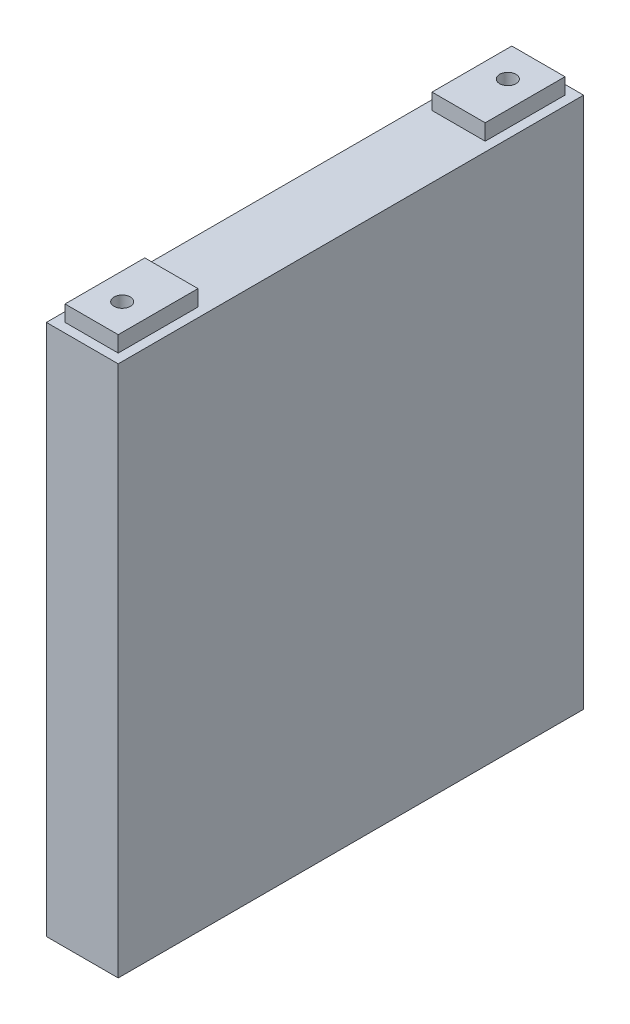
ISO-10303-21;
HEADER;
FILE_DESCRIPTION(('STEP AP214'),'2;1');
FILE_NAME('part.step','',(''),(''),'','','');
FILE_SCHEMA(('AUTOMOTIVE_DESIGN { 1 0 10303 214 1 1 1 1 }'));
ENDSEC;
DATA;
#1=APPLICATION_CONTEXT('core data for automotive mechanical design processes');
#2=APPLICATION_PROTOCOL_DEFINITION('international standard','automotive_design',2000,#1);
#3=PRODUCT_CONTEXT('',#1,'mechanical');
#4=PRODUCT('Part','Part','',(#3));
#5=PRODUCT_RELATED_PRODUCT_CATEGORY('part','',(#4));
#6=PRODUCT_DEFINITION_FORMATION('','',#4);
#7=PRODUCT_DEFINITION_CONTEXT('part definition',#1,'design');
#8=PRODUCT_DEFINITION('design','',#6,#7);
#9=PRODUCT_DEFINITION_SHAPE('','',#8);
#10=(LENGTH_UNIT() NAMED_UNIT(*) SI_UNIT(.MILLI.,.METRE.));
#11=(NAMED_UNIT(*) PLANE_ANGLE_UNIT() SI_UNIT($,.RADIAN.));
#12=(NAMED_UNIT(*) SI_UNIT($,.STERADIAN.) SOLID_ANGLE_UNIT());
#13=UNCERTAINTY_MEASURE_WITH_UNIT(LENGTH_MEASURE(1.E-05),#10,'distance_accuracy_value','');
#14=(GEOMETRIC_REPRESENTATION_CONTEXT(3) GLOBAL_UNCERTAINTY_ASSIGNED_CONTEXT((#13)) GLOBAL_UNIT_ASSIGNED_CONTEXT((#10,
#11,#12)) REPRESENTATION_CONTEXT('',''));
#15=CARTESIAN_POINT('',(0.,0.,0.));
#16=DIRECTION('',(0.,0.,1.));
#17=DIRECTION('',(1.,0.,0.));
#18=AXIS2_PLACEMENT_3D('',#15,#16,#17);
#19=CARTESIAN_POINT('',(13.5,200.,87.5));
#20=DIRECTION('',(-1.,0.,0.));
#21=DIRECTION('',(0.,0.,1.));
#22=AXIS2_PLACEMENT_3D('',#19,#20,#21);
#23=PLANE('',#22);
#24=DIRECTION('',(0.,0.,-1.));
#25=VECTOR('',#24,1.);
#26=CARTESIAN_POINT('',(13.5,0.,87.5));
#27=LINE('',#26,#25);
#28=CARTESIAN_POINT('',(13.5,0.,87.5));
#29=VERTEX_POINT('',#28);
#30=CARTESIAN_POINT('',(13.5,0.,-87.5));
#31=VERTEX_POINT('',#30);
#32=EDGE_CURVE('E234',#29,#31,#27,.T.);
#33=ORIENTED_EDGE('',*,*,#32,.T.);
#34=DIRECTION('',(0.,-1.,0.));
#35=VECTOR('',#34,1.);
#36=CARTESIAN_POINT('',(13.5,200.,-87.5));
#37=LINE('',#36,#35);
#38=CARTESIAN_POINT('',(13.5,200.,-87.5));
#39=VERTEX_POINT('',#38);
#40=EDGE_CURVE('E11',#39,#31,#37,.T.);
#41=ORIENTED_EDGE('',*,*,#40,.F.);
#42=DIRECTION('',(0.,0.,-1.));
#43=VECTOR('',#42,1.);
#44=CARTESIAN_POINT('',(13.5,200.,87.5));
#45=LINE('',#44,#43);
#46=CARTESIAN_POINT('',(13.5,200.,87.5));
#47=VERTEX_POINT('',#46);
#48=EDGE_CURVE('E235',#47,#39,#45,.T.);
#49=ORIENTED_EDGE('',*,*,#48,.F.);
#50=DIRECTION('',(0.,-1.,0.));
#51=VECTOR('',#50,1.);
#52=CARTESIAN_POINT('',(13.5,200.,87.5));
#53=LINE('',#52,#51);
#54=EDGE_CURVE('E249',#47,#29,#53,.T.);
#55=ORIENTED_EDGE('',*,*,#54,.T.);
#56=EDGE_LOOP('',(#33,#41,#49,#55));
#57=FACE_BOUND('',#56,.T.);
#58=ADVANCED_FACE('F42',(#57),#23,.F.);
#59=CARTESIAN_POINT('',(-13.5,200.,-87.5));
#60=DIRECTION('',(0.,0.,1.));
#61=DIRECTION('',(1.,0.,0.));
#62=AXIS2_PLACEMENT_3D('',#59,#60,#61);
#63=PLANE('',#62);
#64=DIRECTION('',(-1.,0.,0.));
#65=VECTOR('',#64,1.);
#66=CARTESIAN_POINT('',(-13.5,0.,-87.5));
#67=LINE('',#66,#65);
#68=CARTESIAN_POINT('',(-13.5,0.,-87.5));
#69=VERTEX_POINT('',#68);
#70=EDGE_CURVE('E253',#31,#69,#67,.T.);
#71=ORIENTED_EDGE('',*,*,#70,.T.);
#72=DIRECTION('',(0.,-1.,0.));
#73=VECTOR('',#72,1.);
#74=CARTESIAN_POINT('',(-13.5,200.,-87.5));
#75=LINE('',#74,#73);
#76=CARTESIAN_POINT('',(-13.5,200.,-87.5));
#77=VERTEX_POINT('',#76);
#78=EDGE_CURVE('E50',#77,#69,#75,.T.);
#79=ORIENTED_EDGE('',*,*,#78,.F.);
#80=DIRECTION('',(-1.,0.,0.));
#81=VECTOR('',#80,1.);
#82=CARTESIAN_POINT('',(-13.5,200.,-87.5));
#83=LINE('',#82,#81);
#84=EDGE_CURVE('E239',#39,#77,#83,.T.);
#85=ORIENTED_EDGE('',*,*,#84,.F.);
#86=ORIENTED_EDGE('',*,*,#40,.T.);
#87=EDGE_LOOP('',(#71,#79,#85,#86));
#88=FACE_BOUND('',#87,.T.);
#89=ADVANCED_FACE('F288',(#88),#63,.F.);
#90=CARTESIAN_POINT('',(-13.5,200.,87.5));
#91=DIRECTION('',(1.,0.,0.));
#92=DIRECTION('',(0.,0.,-1.));
#93=AXIS2_PLACEMENT_3D('',#90,#91,#92);
#94=PLANE('',#93);
#95=DIRECTION('',(0.,0.,1.));
#96=VECTOR('',#95,1.);
#97=CARTESIAN_POINT('',(-13.5,0.,87.5));
#98=LINE('',#97,#96);
#99=CARTESIAN_POINT('',(-13.5,0.,87.5));
#100=VERTEX_POINT('',#99);
#101=EDGE_CURVE('E256',#69,#100,#98,.T.);
#102=ORIENTED_EDGE('',*,*,#101,.T.);
#103=DIRECTION('',(0.,-1.,0.));
#104=VECTOR('',#103,1.);
#105=CARTESIAN_POINT('',(-13.5,200.,87.5));
#106=LINE('',#105,#104);
#107=CARTESIAN_POINT('',(-13.5,200.,87.5));
#108=VERTEX_POINT('',#107);
#109=EDGE_CURVE('E264',#108,#100,#106,.T.);
#110=ORIENTED_EDGE('',*,*,#109,.F.);
#111=DIRECTION('',(0.,0.,1.));
#112=VECTOR('',#111,1.);
#113=CARTESIAN_POINT('',(-13.5,200.,87.5));
#114=LINE('',#113,#112);
#115=EDGE_CURVE('E243',#77,#108,#114,.T.);
#116=ORIENTED_EDGE('',*,*,#115,.F.);
#117=ORIENTED_EDGE('',*,*,#78,.T.);
#118=EDGE_LOOP('',(#102,#110,#116,#117));
#119=FACE_BOUND('',#118,.T.);
#120=ADVANCED_FACE('F273',(#119),#94,.F.);
#121=CARTESIAN_POINT('',(-13.5,200.,87.5));
#122=DIRECTION('',(0.,0.,-1.));
#123=DIRECTION('',(-1.,0.,0.));
#124=AXIS2_PLACEMENT_3D('',#121,#122,#123);
#125=PLANE('',#124);
#126=DIRECTION('',(1.,0.,0.));
#127=VECTOR('',#126,1.);
#128=CARTESIAN_POINT('',(-13.5,0.,87.5));
#129=LINE('',#128,#127);
#130=EDGE_CURVE('E240',#100,#29,#129,.T.);
#131=ORIENTED_EDGE('',*,*,#130,.T.);
#132=ORIENTED_EDGE('',*,*,#54,.F.);
#133=DIRECTION('',(1.,0.,0.));
#134=VECTOR('',#133,1.);
#135=CARTESIAN_POINT('',(-13.5,200.,87.5));
#136=LINE('',#135,#134);
#137=EDGE_CURVE('E246',#108,#47,#136,.T.);
#138=ORIENTED_EDGE('',*,*,#137,.F.);
#139=ORIENTED_EDGE('',*,*,#109,.T.);
#140=EDGE_LOOP('',(#131,#132,#138,#139));
#141=FACE_BOUND('',#140,.T.);
#142=ADVANCED_FACE('F282',(#141),#125,.F.);
#143=CARTESIAN_POINT('',(0.,200.,0.));
#144=DIRECTION('',(0.,-1.,0.));
#145=DIRECTION('',(0.,0.,-1.));
#146=AXIS2_PLACEMENT_3D('',#143,#144,#145);
#147=PLANE('',#146);
#148=DIRECTION('',(0.,0.,-1.));
#149=VECTOR('',#148,1.);
#150=CARTESIAN_POINT('',(10.,200.,-54.));
#151=LINE('',#150,#149);
#152=CARTESIAN_POINT('',(10.,200.,-54.));
#153=VERTEX_POINT('',#152);
#154=CARTESIAN_POINT('',(10.,200.,-84.));
#155=VERTEX_POINT('',#154);
#156=EDGE_CURVE('E127',#153,#155,#151,.T.);
#157=ORIENTED_EDGE('',*,*,#156,.F.);
#158=DIRECTION('',(1.,0.,0.));
#159=VECTOR('',#158,1.);
#160=CARTESIAN_POINT('',(-10.,200.,-54.));
#161=LINE('',#160,#159);
#162=CARTESIAN_POINT('',(-10.,200.,-54.));
#163=VERTEX_POINT('',#162);
#164=EDGE_CURVE('E131',#163,#153,#161,.T.);
#165=ORIENTED_EDGE('',*,*,#164,.F.);
#166=DIRECTION('',(0.,0.,1.));
#167=VECTOR('',#166,1.);
#168=CARTESIAN_POINT('',(-10.,200.,-54.));
#169=LINE('',#168,#167);
#170=CARTESIAN_POINT('',(-10.,200.,-84.));
#171=VERTEX_POINT('',#170);
#172=EDGE_CURVE('E62',#171,#163,#169,.T.);
#173=ORIENTED_EDGE('',*,*,#172,.F.);
#174=DIRECTION('',(-1.,0.,0.));
#175=VECTOR('',#174,1.);
#176=CARTESIAN_POINT('',(-10.,200.,-84.));
#177=LINE('',#176,#175);
#178=EDGE_CURVE('E57',#155,#171,#177,.T.);
#179=ORIENTED_EDGE('',*,*,#178,.F.);
#180=EDGE_LOOP('',(#157,#165,#173,#179));
#181=FACE_BOUND('',#180,.T.);
#182=DIRECTION('',(0.,0.,-1.));
#183=VECTOR('',#182,1.);
#184=CARTESIAN_POINT('',(10.,200.,84.));
#185=LINE('',#184,#183);
#186=CARTESIAN_POINT('',(10.,200.,84.));
#187=VERTEX_POINT('',#186);
#188=CARTESIAN_POINT('',(10.,200.,54.));
#189=VERTEX_POINT('',#188);
#190=EDGE_CURVE('E186',#187,#189,#185,.T.);
#191=ORIENTED_EDGE('',*,*,#190,.F.);
#192=DIRECTION('',(1.,0.,0.));
#193=VECTOR('',#192,1.);
#194=CARTESIAN_POINT('',(-9.99999999999999,200.,84.));
#195=LINE('',#194,#193);
#196=CARTESIAN_POINT('',(-9.99999999999999,200.,84.));
#197=VERTEX_POINT('',#196);
#198=EDGE_CURVE('E195',#197,#187,#195,.T.);
#199=ORIENTED_EDGE('',*,*,#198,.F.);
#200=DIRECTION('',(0.,0.,1.));
#201=VECTOR('',#200,1.);
#202=CARTESIAN_POINT('',(-9.99999999999999,200.,84.));
#203=LINE('',#202,#201);
#204=CARTESIAN_POINT('',(-9.99999999999999,200.,54.));
#205=VERTEX_POINT('',#204);
#206=EDGE_CURVE('E212',#205,#197,#203,.T.);
#207=ORIENTED_EDGE('',*,*,#206,.F.);
#208=DIRECTION('',(-1.,0.,0.));
#209=VECTOR('',#208,1.);
#210=CARTESIAN_POINT('',(-9.99999999999999,200.,54.));
#211=LINE('',#210,#209);
#212=EDGE_CURVE('E208',#189,#205,#211,.T.);
#213=ORIENTED_EDGE('',*,*,#212,.F.);
#214=EDGE_LOOP('',(#191,#199,#207,#213));
#215=FACE_BOUND('',#214,.T.);
#216=ORIENTED_EDGE('',*,*,#48,.T.);
#217=ORIENTED_EDGE('',*,*,#84,.T.);
#218=ORIENTED_EDGE('',*,*,#115,.T.);
#219=ORIENTED_EDGE('',*,*,#137,.T.);
#220=EDGE_LOOP('',(#216,#217,#218,#219));
#221=FACE_BOUND('',#220,.T.);
#222=ADVANCED_FACE('F129',(#181,#215,#221),#147,.F.);
#223=CARTESIAN_POINT('',(0.,0.,0.));
#224=DIRECTION('',(0.,-1.,0.));
#225=DIRECTION('',(0.,0.,-1.));
#226=AXIS2_PLACEMENT_3D('',#223,#224,#225);
#227=PLANE('',#226);
#228=ORIENTED_EDGE('',*,*,#32,.F.);
#229=ORIENTED_EDGE('',*,*,#130,.F.);
#230=ORIENTED_EDGE('',*,*,#101,.F.);
#231=ORIENTED_EDGE('',*,*,#70,.F.);
#232=EDGE_LOOP('',(#228,#229,#230,#231));
#233=FACE_BOUND('',#232,.T.);
#234=ADVANCED_FACE('F279',(#233),#227,.T.);
#235=CARTESIAN_POINT('',(0.,206.,0.));
#236=DIRECTION('',(0.,-1.,0.));
#237=DIRECTION('',(0.,0.,-1.));
#238=AXIS2_PLACEMENT_3D('',#235,#236,#237);
#239=PLANE('',#238);
#240=DIRECTION('',(0.,0.,-1.));
#241=VECTOR('',#240,1.);
#242=CARTESIAN_POINT('',(10.,206.,84.));
#243=LINE('',#242,#241);
#244=CARTESIAN_POINT('',(10.,206.,84.));
#245=VERTEX_POINT('',#244);
#246=CARTESIAN_POINT('',(10.,206.,54.));
#247=VERTEX_POINT('',#246);
#248=EDGE_CURVE('E190',#245,#247,#243,.T.);
#249=ORIENTED_EDGE('',*,*,#248,.T.);
#250=DIRECTION('',(-1.,0.,0.));
#251=VECTOR('',#250,1.);
#252=CARTESIAN_POINT('',(-9.99999999999999,206.,54.));
#253=LINE('',#252,#251);
#254=CARTESIAN_POINT('',(-9.99999999999999,206.,54.));
#255=VERTEX_POINT('',#254);
#256=EDGE_CURVE('E194',#247,#255,#253,.T.);
#257=ORIENTED_EDGE('',*,*,#256,.T.);
#258=DIRECTION('',(0.,0.,1.));
#259=VECTOR('',#258,1.);
#260=CARTESIAN_POINT('',(-9.99999999999999,206.,84.));
#261=LINE('',#260,#259);
#262=CARTESIAN_POINT('',(-9.99999999999999,206.,84.));
#263=VERTEX_POINT('',#262);
#264=EDGE_CURVE('E198',#255,#263,#261,.T.);
#265=ORIENTED_EDGE('',*,*,#264,.T.);
#266=DIRECTION('',(1.,0.,0.));
#267=VECTOR('',#266,1.);
#268=CARTESIAN_POINT('',(-9.99999999999999,206.,84.));
#269=LINE('',#268,#267);
#270=EDGE_CURVE('E201',#263,#245,#269,.T.);
#271=ORIENTED_EDGE('',*,*,#270,.T.);
#272=EDGE_LOOP('',(#249,#257,#265,#271));
#273=FACE_BOUND('',#272,.T.);
#274=CARTESIAN_POINT('',(0.,206.,72.5));
#275=DIRECTION('',(0.,1.,0.));
#276=DIRECTION('',(0.,0.,1.));
#277=AXIS2_PLACEMENT_3D('',#274,#275,#276);
#278=CIRCLE('',#277,3.07188082464344);
#279=CARTESIAN_POINT('',(0.,206.,75.5718808246434));
#280=VERTEX_POINT('',#279);
#281=EDGE_CURVE('E182',#280,#280,#278,.T.);
#282=ORIENTED_EDGE('',*,*,#281,.F.);
#283=EDGE_LOOP('',(#282));
#284=FACE_BOUND('',#283,.T.);
#285=ADVANCED_FACE('F300',(#273,#284),#239,.F.);
#286=CARTESIAN_POINT('',(10.,206.,84.));
#287=DIRECTION('',(-1.,0.,0.));
#288=DIRECTION('',(0.,0.,1.));
#289=AXIS2_PLACEMENT_3D('',#286,#287,#288);
#290=PLANE('',#289);
#291=ORIENTED_EDGE('',*,*,#190,.T.);
#292=DIRECTION('',(0.,-1.,0.));
#293=VECTOR('',#292,1.);
#294=CARTESIAN_POINT('',(10.,206.,54.));
#295=LINE('',#294,#293);
#296=EDGE_CURVE('E230',#247,#189,#295,.T.);
#297=ORIENTED_EDGE('',*,*,#296,.F.);
#298=ORIENTED_EDGE('',*,*,#248,.F.);
#299=DIRECTION('',(0.,-1.,0.));
#300=VECTOR('',#299,1.);
#301=CARTESIAN_POINT('',(10.,206.,84.));
#302=LINE('',#301,#300);
#303=EDGE_CURVE('E204',#245,#187,#302,.T.);
#304=ORIENTED_EDGE('',*,*,#303,.T.);
#305=EDGE_LOOP('',(#291,#297,#298,#304));
#306=FACE_BOUND('',#305,.T.);
#307=ADVANCED_FACE('F305',(#306),#290,.F.);
#308=CARTESIAN_POINT('',(-9.99999999999999,206.,54.));
#309=DIRECTION('',(0.,0.,1.));
#310=DIRECTION('',(1.,0.,0.));
#311=AXIS2_PLACEMENT_3D('',#308,#309,#310);
#312=PLANE('',#311);
#313=ORIENTED_EDGE('',*,*,#212,.T.);
#314=DIRECTION('',(0.,-1.,0.));
#315=VECTOR('',#314,1.);
#316=CARTESIAN_POINT('',(-9.99999999999999,206.,54.));
#317=LINE('',#316,#315);
#318=EDGE_CURVE('E226',#255,#205,#317,.T.);
#319=ORIENTED_EDGE('',*,*,#318,.F.);
#320=ORIENTED_EDGE('',*,*,#256,.F.);
#321=ORIENTED_EDGE('',*,*,#296,.T.);
#322=EDGE_LOOP('',(#313,#319,#320,#321));
#323=FACE_BOUND('',#322,.T.);
#324=ADVANCED_FACE('F308',(#323),#312,.F.);
#325=CARTESIAN_POINT('',(-9.99999999999999,206.,84.));
#326=DIRECTION('',(1.,0.,0.));
#327=DIRECTION('',(0.,0.,-1.));
#328=AXIS2_PLACEMENT_3D('',#325,#326,#327);
#329=PLANE('',#328);
#330=ORIENTED_EDGE('',*,*,#206,.T.);
#331=DIRECTION('',(0.,-1.,0.));
#332=VECTOR('',#331,1.);
#333=CARTESIAN_POINT('',(-9.99999999999999,206.,84.));
#334=LINE('',#333,#332);
#335=EDGE_CURVE('E222',#263,#197,#334,.T.);
#336=ORIENTED_EDGE('',*,*,#335,.F.);
#337=ORIENTED_EDGE('',*,*,#264,.F.);
#338=ORIENTED_EDGE('',*,*,#318,.T.);
#339=EDGE_LOOP('',(#330,#336,#337,#338));
#340=FACE_BOUND('',#339,.T.);
#341=ADVANCED_FACE('F312',(#340),#329,.F.);
#342=CARTESIAN_POINT('',(-9.99999999999999,206.,84.));
#343=DIRECTION('',(0.,0.,-1.));
#344=DIRECTION('',(-1.,0.,0.));
#345=AXIS2_PLACEMENT_3D('',#342,#343,#344);
#346=PLANE('',#345);
#347=ORIENTED_EDGE('',*,*,#198,.T.);
#348=ORIENTED_EDGE('',*,*,#303,.F.);
#349=ORIENTED_EDGE('',*,*,#270,.F.);
#350=ORIENTED_EDGE('',*,*,#335,.T.);
#351=EDGE_LOOP('',(#347,#348,#349,#350));
#352=FACE_BOUND('',#351,.T.);
#353=ADVANCED_FACE('F316',(#352),#346,.F.);
#354=CARTESIAN_POINT('',(0.,206.,72.5));
#355=DIRECTION('',(0.,-1.,0.));
#356=DIRECTION('',(0.,0.,-1.));
#357=AXIS2_PLACEMENT_3D('',#354,#355,#356);
#358=CYLINDRICAL_SURFACE('',#357,3.07188082464344);
#359=ORIENTED_EDGE('',*,*,#281,.T.);
#360=EDGE_LOOP('',(#359));
#361=FACE_BOUND('',#360,.T.);
#362=CARTESIAN_POINT('',(0.,200.,72.5));
#363=DIRECTION('',(0.,1.,0.));
#364=DIRECTION('',(0.,0.,1.));
#365=AXIS2_PLACEMENT_3D('',#362,#363,#364);
#366=CIRCLE('',#365,3.07188082464344);
#367=CARTESIAN_POINT('',(0.,200.,75.5718808246434));
#368=VERTEX_POINT('',#367);
#369=EDGE_CURVE('E178',#368,#368,#366,.T.);
#370=ORIENTED_EDGE('',*,*,#369,.F.);
#371=EDGE_LOOP('',(#370));
#372=FACE_BOUND('',#371,.T.);
#373=ADVANCED_FACE('F320',(#361,#372),#358,.F.);
#374=ORIENTED_EDGE('',*,*,#369,.T.);
#375=EDGE_LOOP('',(#374));
#376=FACE_BOUND('',#375,.T.);
#377=ADVANCED_FACE('F304',(#376),#147,.F.);
#378=CARTESIAN_POINT('',(0.,206.,0.));
#379=DIRECTION('',(0.,-1.,0.));
#380=DIRECTION('',(0.,0.,-1.));
#381=AXIS2_PLACEMENT_3D('',#378,#379,#380);
#382=PLANE('',#381);
#383=DIRECTION('',(0.,0.,-1.));
#384=VECTOR('',#383,1.);
#385=CARTESIAN_POINT('',(10.,206.,-54.));
#386=LINE('',#385,#384);
#387=CARTESIAN_POINT('',(10.,206.,-54.));
#388=VERTEX_POINT('',#387);
#389=CARTESIAN_POINT('',(10.,206.,-84.));
#390=VERTEX_POINT('',#389);
#391=EDGE_CURVE('E148',#388,#390,#386,.T.);
#392=ORIENTED_EDGE('',*,*,#391,.T.);
#393=DIRECTION('',(-1.,0.,0.));
#394=VECTOR('',#393,1.);
#395=CARTESIAN_POINT('',(-10.,206.,-84.));
#396=LINE('',#395,#394);
#397=CARTESIAN_POINT('',(-10.,206.,-84.));
#398=VERTEX_POINT('',#397);
#399=EDGE_CURVE('E169',#390,#398,#396,.T.);
#400=ORIENTED_EDGE('',*,*,#399,.T.);
#401=DIRECTION('',(0.,0.,1.));
#402=VECTOR('',#401,1.);
#403=CARTESIAN_POINT('',(-10.,206.,-54.));
#404=LINE('',#403,#402);
#405=CARTESIAN_POINT('',(-10.,206.,-54.));
#406=VERTEX_POINT('',#405);
#407=EDGE_CURVE('E157',#398,#406,#404,.T.);
#408=ORIENTED_EDGE('',*,*,#407,.T.);
#409=DIRECTION('',(1.,0.,0.));
#410=VECTOR('',#409,1.);
#411=CARTESIAN_POINT('',(-10.,206.,-54.));
#412=LINE('',#411,#410);
#413=EDGE_CURVE('E153',#406,#388,#412,.T.);
#414=ORIENTED_EDGE('',*,*,#413,.T.);
#415=EDGE_LOOP('',(#392,#400,#408,#414));
#416=FACE_BOUND('',#415,.T.);
#417=CARTESIAN_POINT('',(0.,206.,-72.5));
#418=DIRECTION('',(0.,1.,0.));
#419=DIRECTION('',(0.,0.,1.));
#420=AXIS2_PLACEMENT_3D('',#417,#418,#419);
#421=CIRCLE('',#420,3.07188082464344);
#422=CARTESIAN_POINT('',(0.,206.,-69.4281191753565));
#423=VERTEX_POINT('',#422);
#424=EDGE_CURVE('E136',#423,#423,#421,.T.);
#425=ORIENTED_EDGE('',*,*,#424,.F.);
#426=EDGE_LOOP('',(#425));
#427=FACE_BOUND('',#426,.T.);
#428=ADVANCED_FACE('F332',(#416,#427),#382,.F.);
#429=CARTESIAN_POINT('',(10.,206.,-54.));
#430=DIRECTION('',(-1.,0.,0.));
#431=DIRECTION('',(0.,0.,1.));
#432=AXIS2_PLACEMENT_3D('',#429,#430,#431);
#433=PLANE('',#432);
#434=ORIENTED_EDGE('',*,*,#156,.T.);
#435=DIRECTION('',(0.,-1.,0.));
#436=VECTOR('',#435,1.);
#437=CARTESIAN_POINT('',(10.,206.,-84.));
#438=LINE('',#437,#436);
#439=EDGE_CURVE('E516',#390,#155,#438,.T.);
#440=ORIENTED_EDGE('',*,*,#439,.F.);
#441=ORIENTED_EDGE('',*,*,#391,.F.);
#442=DIRECTION('',(0.,-1.,0.));
#443=VECTOR('',#442,1.);
#444=CARTESIAN_POINT('',(10.,206.,-54.));
#445=LINE('',#444,#443);
#446=EDGE_CURVE('E143',#388,#153,#445,.T.);
#447=ORIENTED_EDGE('',*,*,#446,.T.);
#448=EDGE_LOOP('',(#434,#440,#441,#447));
#449=FACE_BOUND('',#448,.T.);
#450=ADVANCED_FACE('F150',(#449),#433,.F.);
#451=CARTESIAN_POINT('',(-10.,206.,-84.));
#452=DIRECTION('',(0.,0.,1.));
#453=DIRECTION('',(1.,0.,0.));
#454=AXIS2_PLACEMENT_3D('',#451,#452,#453);
#455=PLANE('',#454);
#456=ORIENTED_EDGE('',*,*,#178,.T.);
#457=DIRECTION('',(0.,-1.,0.));
#458=VECTOR('',#457,1.);
#459=CARTESIAN_POINT('',(-10.,206.,-84.));
#460=LINE('',#459,#458);
#461=EDGE_CURVE('E159',#398,#171,#460,.T.);
#462=ORIENTED_EDGE('',*,*,#461,.F.);
#463=ORIENTED_EDGE('',*,*,#399,.F.);
#464=ORIENTED_EDGE('',*,*,#439,.T.);
#465=EDGE_LOOP('',(#456,#462,#463,#464));
#466=FACE_BOUND('',#465,.T.);
#467=ADVANCED_FACE('F341',(#466),#455,.F.);
#468=CARTESIAN_POINT('',(-10.,206.,-54.));
#469=DIRECTION('',(1.,0.,0.));
#470=DIRECTION('',(0.,0.,-1.));
#471=AXIS2_PLACEMENT_3D('',#468,#469,#470);
#472=PLANE('',#471);
#473=ORIENTED_EDGE('',*,*,#172,.T.);
#474=DIRECTION('',(0.,-1.,0.));
#475=VECTOR('',#474,1.);
#476=CARTESIAN_POINT('',(-10.,206.,-54.));
#477=LINE('',#476,#475);
#478=EDGE_CURVE('E146',#406,#163,#477,.T.);
#479=ORIENTED_EDGE('',*,*,#478,.F.);
#480=ORIENTED_EDGE('',*,*,#407,.F.);
#481=ORIENTED_EDGE('',*,*,#461,.T.);
#482=EDGE_LOOP('',(#473,#479,#480,#481));
#483=FACE_BOUND('',#482,.T.);
#484=ADVANCED_FACE('F338',(#483),#472,.F.);
#485=CARTESIAN_POINT('',(-10.,206.,-54.));
#486=DIRECTION('',(0.,0.,-1.));
#487=DIRECTION('',(-1.,0.,0.));
#488=AXIS2_PLACEMENT_3D('',#485,#486,#487);
#489=PLANE('',#488);
#490=ORIENTED_EDGE('',*,*,#164,.T.);
#491=ORIENTED_EDGE('',*,*,#446,.F.);
#492=ORIENTED_EDGE('',*,*,#413,.F.);
#493=ORIENTED_EDGE('',*,*,#478,.T.);
#494=EDGE_LOOP('',(#490,#491,#492,#493));
#495=FACE_BOUND('',#494,.T.);
#496=ADVANCED_FACE('F141',(#495),#489,.F.);
#497=CARTESIAN_POINT('',(0.,206.,-72.5));
#498=DIRECTION('',(0.,-1.,0.));
#499=DIRECTION('',(0.,0.,-1.));
#500=AXIS2_PLACEMENT_3D('',#497,#498,#499);
#501=CYLINDRICAL_SURFACE('',#500,3.07188082464344);
#502=ORIENTED_EDGE('',*,*,#424,.T.);
#503=EDGE_LOOP('',(#502));
#504=FACE_BOUND('',#503,.T.);
#505=CARTESIAN_POINT('',(0.,200.,-72.5));
#506=DIRECTION('',(0.,1.,0.));
#507=DIRECTION('',(0.,0.,1.));
#508=AXIS2_PLACEMENT_3D('',#505,#506,#507);
#509=CIRCLE('',#508,3.07188082464344);
#510=CARTESIAN_POINT('',(0.,200.,-69.4281191753565));
#511=VERTEX_POINT('',#510);
#512=EDGE_CURVE('E174',#511,#511,#509,.T.);
#513=ORIENTED_EDGE('',*,*,#512,.F.);
#514=EDGE_LOOP('',(#513));
#515=FACE_BOUND('',#514,.T.);
#516=ADVANCED_FACE('F328',(#504,#515),#501,.F.);
#517=ORIENTED_EDGE('',*,*,#512,.T.);
#518=EDGE_LOOP('',(#517));
#519=FACE_BOUND('',#518,.T.);
#520=ADVANCED_FACE('F303',(#519),#147,.F.);
#521=CLOSED_SHELL('',(#58,#89,#120,#142,#222,#234,#285,#307,#324,#341,#353,#373,#377,#428,#450,
#467,#484,#496,#516,#520));
#522=MANIFOLD_SOLID_BREP('B2',#521);
#523=ADVANCED_BREP_SHAPE_REPRESENTATION('',(#18,#522),#14);
#524=SHAPE_DEFINITION_REPRESENTATION(#9,#523);
ENDSEC;
END-ISO-10303-21;
